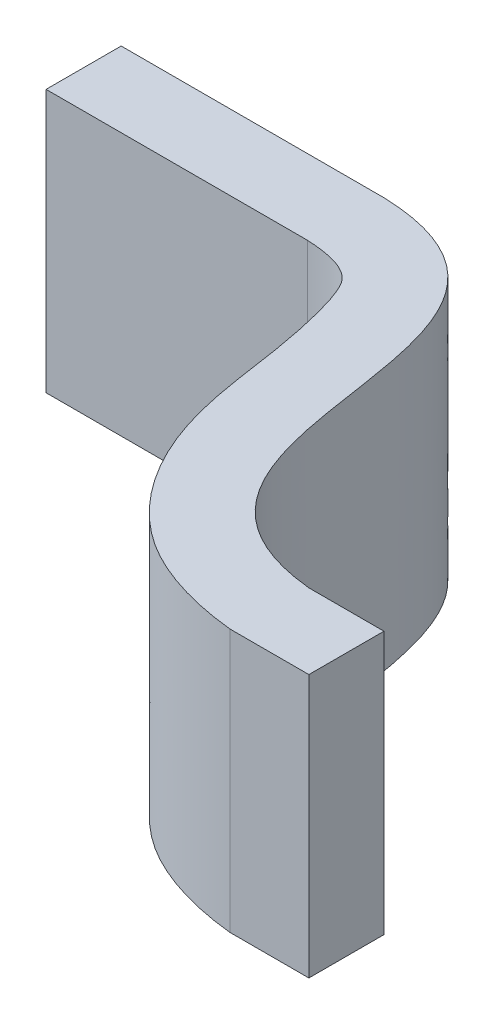
ISO-10303-21;
HEADER;
FILE_DESCRIPTION(('STEP AP214'),'2;1');
FILE_NAME('part.step','',(''),(''),'','','');
FILE_SCHEMA(('AUTOMOTIVE_DESIGN { 1 0 10303 214 1 1 1 1 }'));
ENDSEC;
DATA;
#1=APPLICATION_CONTEXT('core data for automotive mechanical design processes');
#2=APPLICATION_PROTOCOL_DEFINITION('international standard','automotive_design',2000,#1);
#3=PRODUCT_CONTEXT('',#1,'mechanical');
#4=PRODUCT('Part','Part','',(#3));
#5=PRODUCT_RELATED_PRODUCT_CATEGORY('part','',(#4));
#6=PRODUCT_DEFINITION_FORMATION('','',#4);
#7=PRODUCT_DEFINITION_CONTEXT('part definition',#1,'design');
#8=PRODUCT_DEFINITION('design','',#6,#7);
#9=PRODUCT_DEFINITION_SHAPE('','',#8);
#10=(LENGTH_UNIT() NAMED_UNIT(*) SI_UNIT(.MILLI.,.METRE.));
#11=(NAMED_UNIT(*) PLANE_ANGLE_UNIT() SI_UNIT($,.RADIAN.));
#12=(NAMED_UNIT(*) SI_UNIT($,.STERADIAN.) SOLID_ANGLE_UNIT());
#13=UNCERTAINTY_MEASURE_WITH_UNIT(LENGTH_MEASURE(1.E-05),#10,'distance_accuracy_value','');
#14=(GEOMETRIC_REPRESENTATION_CONTEXT(3) GLOBAL_UNCERTAINTY_ASSIGNED_CONTEXT((#13)) GLOBAL_UNIT_ASSIGNED_CONTEXT((#10,
#11,#12)) REPRESENTATION_CONTEXT('',''));
#15=CARTESIAN_POINT('',(0.,0.,0.));
#16=DIRECTION('',(0.,0.,1.));
#17=DIRECTION('',(1.,0.,0.));
#18=AXIS2_PLACEMENT_3D('',#15,#16,#17);
#19=CARTESIAN_POINT('',(0.381062000989914,-1.47687603414217,1.19999994098963));
#20=DIRECTION('',(0.,-1.,-4.37113882867379E-08));
#21=DIRECTION('',(1.,0.,0.));
#22=AXIS2_PLACEMENT_3D('',#19,#20,#21);
#23=PLANE('',#22);
#24=CARTESIAN_POINT('',(-6.65393799901009,-1.47687602539989,0.999999940989626));
#25=CARTESIAN_POINT('',(-6.67603378247592,-1.47687602530467,0.997821450801583));
#26=CARTESIAN_POINT('',(-6.69814608533159,-1.47687602516058,0.994525079742583));
#27=CARTESIAN_POINT('',(-6.74196000230599,-1.47687602474309,0.98497408722883));
#28=CARTESIAN_POINT('',(-6.76365439120462,-1.47687602446828,0.97868722086885));
#29=CARTESIAN_POINT('',(-6.80109928914061,-1.47687602383577,0.964217149326462));
#30=CARTESIAN_POINT('',(-6.81711598043367,-1.47687602350913,0.956744245104065));
#31=CARTESIAN_POINT('',(-6.84771104371223,-1.47687602275081,0.939395998406596));
#32=CARTESIAN_POINT('',(-6.86229582381613,-1.47687602231964,0.929532115974731));
#33=CARTESIAN_POINT('',(-6.88913715455262,-1.47687602137223,0.907857908125021));
#34=CARTESIAN_POINT('',(-6.90145549336788,-1.47687602085934,0.896124168112713));
#35=CARTESIAN_POINT('',(-6.92410333203055,-1.47687601975463,0.870851289617725));
#36=CARTESIAN_POINT('',(-6.93442941955475,-1.47687601916268,0.857309119609302));
#37=CARTESIAN_POINT('',(-6.96672356560466,-1.47687601701589,0.808196481414667));
#38=CARTESIAN_POINT('',(-6.98364579428104,-1.47687601531836,0.769361496281231));
#39=CARTESIAN_POINT('',(-7.00637915120374,-1.47687601228944,0.700067708109999));
#40=CARTESIAN_POINT('',(-7.01393277364121,-1.47687601097706,0.67004395919194));
#41=CARTESIAN_POINT('',(-7.02681062279047,-1.47687600832878,0.609458378700427));
#42=CARTESIAN_POINT('',(-7.03213106678493,-1.47687600699284,0.578895724783763));
#43=CARTESIAN_POINT('',(-7.04523612787774,-1.476876003414,0.497021439048199));
#44=CARTESIAN_POINT('',(-7.0522656284455,-1.4768760011665,0.445604616201525));
#45=CARTESIAN_POINT('',(-7.06583829430569,-1.47687599781692,0.368975133259858));
#46=CARTESIAN_POINT('',(-7.0708647695897,-1.47687599670442,0.343524166788316));
#47=CARTESIAN_POINT('',(-7.08290131021325,-1.4768759945012,0.29312028903324));
#48=CARTESIAN_POINT('',(-7.08990811721131,-1.47687599341044,0.268166631105824));
#49=CARTESIAN_POINT('',(-7.10754242158977,-1.47687599122937,0.21826958117502));
#50=CARTESIAN_POINT('',(-7.11830963205074,-1.47687599014101,0.193370641435788));
#51=CARTESIAN_POINT('',(-7.13814509854049,-1.47687598860283,0.158181201453993));
#52=CARTESIAN_POINT('',(-7.14534233177561,-1.47687598810726,0.146843907751027));
#53=CARTESIAN_POINT('',(-7.16105988122924,-1.47687598715831,0.125134493644536));
#54=CARTESIAN_POINT('',(-7.16957893209141,-1.47687598670489,0.114761465194491));
#55=CARTESIAN_POINT('',(-7.19091439754605,-1.47687598571422,0.0920975480052601));
#56=CARTESIAN_POINT('',(-7.20423043199209,-1.47687598519713,0.0802679863135992));
#57=CARTESIAN_POINT('',(-7.23280529274656,-1.47687598427693,0.0592161697720485));
#58=CARTESIAN_POINT('',(-7.24806736713441,-1.476875983874,0.0499983589534038));
#59=CARTESIAN_POINT('',(-7.28055680499388,-1.47687598316908,0.0338717762435262));
#60=CARTESIAN_POINT('',(-7.29784019259106,-1.47687598287213,0.0270780966533548));
#61=CARTESIAN_POINT('',(-7.33320890349723,-1.47687598238776,0.0159970143758756));
#62=CARTESIAN_POINT('',(-7.35129600434054,-1.47687598220061,0.0117154982372897));
#63=CARTESIAN_POINT('',(-7.383534227059,-1.47687598194948,0.00597045282360196));
#64=CARTESIAN_POINT('',(-7.39761496113673,-1.47687598186693,0.00408176859856541));
#65=CARTESIAN_POINT('',(-7.42577624030721,-1.47687598174668,0.00133077820344091));
#66=CARTESIAN_POINT('',(-7.43985605615936,-1.47687598170866,0.000461176785633499));
#67=CARTESIAN_POINT('',(-7.45393799901012,-1.4768759816885,-5.90103753674717E-08));
#68=B_SPLINE_CURVE_WITH_KNOTS('',3,(#24,#25,#26,#27,#28,#29,#30,#31,#32,#33,#34,#35,#36,#37,#38,
#39,#40,#41,#42,#43,#44,#45,#46,#47,#48,#49,#50,#51,#52,#53,#54,#55,#56,#57,#58,#59,#60,#61,#62,
#63,#64,#65,#66,#67),.UNSPECIFIED.,.F.,.F.,(4,2,2,2,2,2,2,2,2,2,2,2,2,2,2,2,2,2,2,2,2,4),(0.,
0.0667821137090827,0.134301214684022,0.187128508823985,0.239707439757734,0.290518731452926,
0.341416294675052,0.466712259088968,0.559563019654505,0.652570428897917,0.808245450373591,
0.886023921415191,0.963675157190781,1.0445878496654,1.08478909463836,1.12495209032637,
1.17807587168456,1.23128951042009,1.2867700351769,1.34238004906254,1.38496468867344,
1.42724258099922),.UNSPECIFIED.);
#69=CARTESIAN_POINT('',(-6.65393799901009,-1.47687602539989,0.999999940989626));
#70=VERTEX_POINT('',#69);
#71=CARTESIAN_POINT('',(-7.45393799901009,-1.4768759816885,-5.90103741870962E-08));
#72=VERTEX_POINT('',#71);
#73=EDGE_CURVE('E11',#70,#72,#68,.T.);
#74=ORIENTED_EDGE('',*,*,#73,.F.);
#75=DIRECTION('',(-1.,0.,0.));
#76=VECTOR('',#75,1.);
#77=CARTESIAN_POINT('',(-6.45393799901009,-1.47687602539989,0.999999940989626));
#78=LINE('',#77,#76);
#79=CARTESIAN_POINT('',(-6.45393799901009,-1.47687602539989,0.999999940989626));
#80=VERTEX_POINT('',#79);
#81=EDGE_CURVE('E179',#80,#70,#78,.T.);
#82=ORIENTED_EDGE('',*,*,#81,.F.);
#83=DIRECTION('',(0.,4.37113878426487E-08,-0.999999999999999));
#84=VECTOR('',#83,1.);
#85=CARTESIAN_POINT('',(-6.45393799901009,-1.47687603414217,1.19999994098963));
#86=LINE('',#85,#84);
#87=CARTESIAN_POINT('',(-6.45393799901009,-1.47687603414217,1.19999994098963));
#88=VERTEX_POINT('',#87);
#89=EDGE_CURVE('E155',#88,#80,#86,.T.);
#90=ORIENTED_EDGE('',*,*,#89,.F.);
#91=DIRECTION('',(-1.,0.,0.));
#92=VECTOR('',#91,1.);
#93=CARTESIAN_POINT('',(-6.45393799901009,-1.47687603414217,1.19999994098963));
#94=LINE('',#93,#92);
#95=CARTESIAN_POINT('',(-6.66373717585809,-1.47687603414217,1.19999994098963));
#96=VERTEX_POINT('',#95);
#97=EDGE_CURVE('E148',#88,#96,#94,.T.);
#98=ORIENTED_EDGE('',*,*,#97,.T.);
#99=CARTESIAN_POINT('',(-6.66373717585809,-1.47687603414217,1.19999994098963));
#100=CARTESIAN_POINT('',(-6.68237056257263,-1.47687603406166,1.19815808766804));
#101=CARTESIAN_POINT('',(-6.70094738722954,-1.47687603395427,1.19570131124008));
#102=CARTESIAN_POINT('',(-6.7379246105478,-1.47687603368307,1.18949691165288));
#103=CARTESIAN_POINT('',(-6.75632454194431,-1.47687603351913,1.18574651415813));
#104=CARTESIAN_POINT('',(-6.7929675339705,-1.47687603313076,1.17686153782507));
#105=CARTESIAN_POINT('',(-6.81120769181061,-1.47687603290579,1.17171480363105));
#106=CARTESIAN_POINT('',(-6.84718412122,-1.47687603239066,1.15993001092061));
#107=CARTESIAN_POINT('',(-6.86492077676558,-1.47687603210055,1.15329312521039));
#108=CARTESIAN_POINT('',(-6.90550702441668,-1.47687603133701,1.1358254120325));
#109=CARTESIAN_POINT('',(-6.92808530032362,-1.47687603083472,1.12433420692271));
#110=CARTESIAN_POINT('',(-6.97098069443299,-1.47687602967858,1.09788498679643));
#111=CARTESIAN_POINT('',(-6.99130790145501,-1.47687602902546,1.08294345008822));
#112=CARTESIAN_POINT('',(-7.0279727762332,-1.47687602765227,1.05152845303654));
#113=CARTESIAN_POINT('',(-7.04449924398274,-1.47687602694167,1.03527175701928));
#114=CARTESIAN_POINT('',(-7.07543365798622,-1.47687602543449,1.00079143835059));
#115=CARTESIAN_POINT('',(-7.08983601944683,-1.47687602463769,0.982562841549026));
#116=CARTESIAN_POINT('',(-7.11809776879426,-1.47687602287818,0.942310060026029));
#117=CARTESIAN_POINT('',(-7.13168204827002,-1.47687602190706,0.920093273546856));
#118=CARTESIAN_POINT('',(-7.15606790009834,-1.47687601990227,0.874229058403105));
#119=CARTESIAN_POINT('',(-7.16687319447414,-1.47687601886869,0.850583596236032));
#120=CARTESIAN_POINT('',(-7.18657911699553,-1.4768760166685,0.800249067769625));
#121=CARTESIAN_POINT('',(-7.19524763842127,-1.47687601549796,0.773470176491148));
#122=CARTESIAN_POINT('',(-7.20996785968964,-1.4768760131256,0.719196920615698));
#123=CARTESIAN_POINT('',(-7.21601637646933,-1.47687601192374,0.691701728512114));
#124=CARTESIAN_POINT('',(-7.22445706680594,-1.47687600995746,0.646718523761128));
#125=CARTESIAN_POINT('',(-7.22737168105378,-1.47687600919702,0.629321384546686));
#126=CARTESIAN_POINT('',(-7.23282112861414,-1.4768760076734,0.594464976282695));
#127=CARTESIAN_POINT('',(-7.23535587567411,-1.47687600691023,0.577005694041488));
#128=CARTESIAN_POINT('',(-7.24044379035748,-1.47687600538413,0.54209274684554));
#129=CARTESIAN_POINT('',(-7.24299695433449,-1.47687600462121,0.524639081456819));
#130=CARTESIAN_POINT('',(-7.24854024165721,-1.47687600309859,0.489805535822996));
#131=CARTESIAN_POINT('',(-7.25153024685593,-1.47687600233888,0.472425636930946));
#132=CARTESIAN_POINT('',(-7.25940543221582,-1.47687600048513,0.430016827455336));
#133=CARTESIAN_POINT('',(-7.26454124775706,-1.47687599939302,0.405032099238831));
#134=CARTESIAN_POINT('',(-7.27335782095331,-1.47687599776612,0.36781282240836));
#135=CARTESIAN_POINT('',(-7.27648289514104,-1.47687599722559,0.355446901764329));
#136=CARTESIAN_POINT('',(-7.2832453862984,-1.47687599615077,0.330858010833507));
#137=CARTESIAN_POINT('',(-7.28688251537886,-1.47687599561647,0.318634964373173));
#138=CARTESIAN_POINT('',(-7.29335647517369,-1.47687599477453,0.299373308638716));
#139=CARTESIAN_POINT('',(-7.29591902475202,-1.47687599446291,0.292243894867466));
#140=CARTESIAN_POINT('',(-7.30149713681058,-1.47687599384776,0.278171806776029));
#141=CARTESIAN_POINT('',(-7.30451201316556,-1.47687599354423,0.271228868086333));
#142=CARTESIAN_POINT('',(-7.31077994191444,-1.47687599300979,0.258999855834234));
#143=CARTESIAN_POINT('',(-7.31388605246379,-1.47687599277584,0.253644679150387));
#144=CARTESIAN_POINT('',(-7.32081621454635,-1.47687599236773,0.244315938153898));
#145=CARTESIAN_POINT('',(-7.32451240161513,-1.47687599218977,0.24025391737416));
#146=CARTESIAN_POINT('',(-7.33396137139944,-1.47687599183375,0.232075907205086));
#147=CARTESIAN_POINT('',(-7.33999881820825,-1.47687599167144,0.228303992977281));
#148=CARTESIAN_POINT('',(-7.34921547868647,-1.47687599144167,0.223113032707355));
#149=CARTESIAN_POINT('',(-7.35230200427145,-1.47687599136763,0.221466101314979));
#150=CARTESIAN_POINT('',(-7.35859228869369,-1.4768759912373,0.218417312752192));
#151=CARTESIAN_POINT('',(-7.36179572518167,-1.47687599118096,0.217014835421493));
#152=CARTESIAN_POINT('',(-7.37091592035366,-1.47687599103315,0.213464983405925));
#153=CARTESIAN_POINT('',(-7.37694933123149,-1.47687599094972,0.211621640271059));
#154=CARTESIAN_POINT('',(-7.38671809463102,-1.47687599083436,0.209137148338985));
#155=CARTESIAN_POINT('',(-7.3904112741511,-1.47687599079516,0.208309634068498));
#156=CARTESIAN_POINT('',(-7.39782685498994,-1.47687599072686,0.206799599147105));
#157=CARTESIAN_POINT('',(-7.40154925199958,-1.47687599069776,0.206117057516812));
#158=CARTESIAN_POINT('',(-7.41391207862736,-1.47687599060798,0.204032017216307));
#159=CARTESIAN_POINT('',(-7.42259188256675,-1.47687599055604,0.202861051319937));
#160=CARTESIAN_POINT('',(-7.43564284724014,-1.47687599049523,0.201476536264861));
#161=CARTESIAN_POINT('',(-7.4399954739608,-1.47687599047782,0.201077162443525));
#162=CARTESIAN_POINT('',(-7.44871111958986,-1.47687599044936,0.20042393173629));
#163=CARTESIAN_POINT('',(-7.45307413753338,-1.47687599043831,0.200170061830806));
#164=CARTESIAN_POINT('',(-7.45744178074609,-1.47687599043078,0.199999940989626));
#165=B_SPLINE_CURVE_WITH_KNOTS('',3,(#99,#100,#101,#102,#103,#104,#105,#106,#107,#108,#109,#110,
#111,#112,#113,#114,#115,#116,#117,#118,#119,#120,#121,#122,#123,#124,#125,#126,#127,#128,#129,
#130,#131,#132,#133,#134,#135,#136,#137,#138,#139,#140,#141,#142,#143,#144,#145,#146,#147,#148,
#149,#150,#151,#152,#153,#154,#155,#156,#157,#158,#159,#160,#161,#162,#163,#164),.UNSPECIFIED.,
.F.,.F.,(4,2,2,2,2,2,2,2,2,2,2,2,2,2,2,2,2,2,2,2,2,2,2,2,2,2,2,2,2,2,2,2,4),(0.,
0.0561681589095703,0.112457534383136,0.169253578612365,0.22600507790688,0.301715004036538,
0.377070566345996,0.446424912055149,0.515958475234815,0.593880428548582,0.671697467408242,
0.755964517163007,0.840333658382206,0.893247792631837,0.946173923407369,0.99908984816416,
1.05199148781441,1.12847716172405,1.16673541076623,1.20497223539783,1.22769072756633,
1.25037510056686,1.26886797593494,1.28517999290264,1.30634908955326,1.31685139211729,
1.32732665061524,1.34619861049413,1.3575513722042,1.36890248990408,1.39515927363249,
1.40827024085607,1.42138003473644),.UNSPECIFIED.);
#166=CARTESIAN_POINT('',(-7.45744178074609,-1.47687599043078,0.199999940989626));
#167=VERTEX_POINT('',#166);
#168=EDGE_CURVE('E196',#96,#167,#165,.T.);
#169=ORIENTED_EDGE('',*,*,#168,.T.);
#170=DIRECTION('',(1.,0.,0.));
#171=VECTOR('',#170,1.);
#172=CARTESIAN_POINT('',(-8.15393799901009,-1.47687599043078,0.199999940989624));
#173=LINE('',#172,#171);
#174=CARTESIAN_POINT('',(-8.15393799901009,-1.47687599043078,0.199999940989626));
#175=VERTEX_POINT('',#174);
#176=EDGE_CURVE('E102',#175,#167,#173,.T.);
#177=ORIENTED_EDGE('',*,*,#176,.F.);
#178=DIRECTION('',(0.,4.37113878426487E-08,-0.999999999999999));
#179=VECTOR('',#178,1.);
#180=CARTESIAN_POINT('',(-8.15393799901009,-1.47687599043078,0.199999940989626));
#181=LINE('',#180,#179);
#182=CARTESIAN_POINT('',(-8.15393799901009,-1.4768759816885,-5.90103741870962E-08));
#183=VERTEX_POINT('',#182);
#184=EDGE_CURVE('E90',#175,#183,#181,.T.);
#185=ORIENTED_EDGE('',*,*,#184,.T.);
#186=DIRECTION('',(-1.,0.,0.));
#187=VECTOR('',#186,1.);
#188=CARTESIAN_POINT('',(-7.45393799901009,-1.4768759816885,-5.90103741870963E-08));
#189=LINE('',#188,#187);
#190=EDGE_CURVE('E100',#72,#183,#189,.T.);
#191=ORIENTED_EDGE('',*,*,#190,.F.);
#192=EDGE_LOOP('',(#74,#82,#90,#98,#169,#177,#185,#191));
#193=FACE_BOUND('',#192,.T.);
#194=ADVANCED_FACE('F17',(#193),#23,.T.);
#195=CARTESIAN_POINT('',(0.381062000989914,-0.776876034142165,1.1999999715876));
#196=DIRECTION('',(0.,-1.,-4.37113882867379E-08));
#197=DIRECTION('',(1.,0.,0.));
#198=AXIS2_PLACEMENT_3D('',#195,#196,#197);
#199=PLANE('',#198);
#200=DIRECTION('',(-1.,0.,0.));
#201=VECTOR('',#200,1.);
#202=CARTESIAN_POINT('',(-6.45393799901009,-0.776876025399889,0.999999971587598));
#203=LINE('',#202,#201);
#204=CARTESIAN_POINT('',(-6.45393799901009,-0.776876025399888,0.999999971587598));
#205=VERTEX_POINT('',#204);
#206=CARTESIAN_POINT('',(-6.65393799901009,-0.776876025399888,0.999999971587598));
#207=VERTEX_POINT('',#206);
#208=EDGE_CURVE('E30',#205,#207,#203,.T.);
#209=ORIENTED_EDGE('',*,*,#208,.T.);
#210=CARTESIAN_POINT('',(-6.65393799901009,-0.776876025399888,0.999999971587598));
#211=CARTESIAN_POINT('',(-6.67603378247592,-0.776876025304664,0.997821481399555));
#212=CARTESIAN_POINT('',(-6.69814608533159,-0.776876025160575,0.994525110340555));
#213=CARTESIAN_POINT('',(-6.74196000230599,-0.776876024743088,0.984974117826802));
#214=CARTESIAN_POINT('',(-6.76365439120462,-0.776876024468281,0.978687251466822));
#215=CARTESIAN_POINT('',(-6.80109928914061,-0.776876023835774,0.964217179924434));
#216=CARTESIAN_POINT('',(-6.81711598043367,-0.776876023509123,0.956744275702038));
#217=CARTESIAN_POINT('',(-6.84771104371223,-0.776876022750807,0.939396029004568));
#218=CARTESIAN_POINT('',(-6.86229582381613,-0.776876022319643,0.929532146572703));
#219=CARTESIAN_POINT('',(-6.88913715455262,-0.776876021372233,0.907857938722992));
#220=CARTESIAN_POINT('',(-6.90145549336788,-0.776876020859335,0.896124198710684));
#221=CARTESIAN_POINT('',(-6.92410333203055,-0.776876019754622,0.870851320215695));
#222=CARTESIAN_POINT('',(-6.93442941955475,-0.776876019162675,0.857309150207273));
#223=CARTESIAN_POINT('',(-6.96672356560466,-0.776876017015892,0.808196512012639));
#224=CARTESIAN_POINT('',(-6.98364579428104,-0.776876015318361,0.769361526879202));
#225=CARTESIAN_POINT('',(-7.00637915120374,-0.776876012289434,0.700067738707971));
#226=CARTESIAN_POINT('',(-7.01393277364121,-0.776876010977055,0.670043989789912));
#227=CARTESIAN_POINT('',(-7.02681062279047,-0.776876008328776,0.609458409298399));
#228=CARTESIAN_POINT('',(-7.03213106678493,-0.776876006992839,0.578895755381735));
#229=CARTESIAN_POINT('',(-7.04523612787774,-0.776876003414,0.497021469646171));
#230=CARTESIAN_POINT('',(-7.0522656284455,-0.7768760011665,0.445604646799497));
#231=CARTESIAN_POINT('',(-7.06583829430569,-0.776875997816919,0.368975163857829));
#232=CARTESIAN_POINT('',(-7.0708647695897,-0.776875996704422,0.343524197386287));
#233=CARTESIAN_POINT('',(-7.08290131021325,-0.776875994501198,0.293120319631211));
#234=CARTESIAN_POINT('',(-7.08990811721131,-0.776875993410439,0.268166661703795));
#235=CARTESIAN_POINT('',(-7.10754242158977,-0.77687599122937,0.218269611772992));
#236=CARTESIAN_POINT('',(-7.11830963205074,-0.776875990141003,0.19337067203376));
#237=CARTESIAN_POINT('',(-7.13814509854049,-0.776875988602823,0.158181232051964));
#238=CARTESIAN_POINT('',(-7.14534233177561,-0.776875988107255,0.146843938348998));
#239=CARTESIAN_POINT('',(-7.16105988122924,-0.776875987158306,0.125134524242507));
#240=CARTESIAN_POINT('',(-7.16957893209141,-0.776875986704887,0.114761495792462));
#241=CARTESIAN_POINT('',(-7.19091439754605,-0.776875985714216,0.0920975786032325));
#242=CARTESIAN_POINT('',(-7.20423043199209,-0.776875985197129,0.0802680169115713));
#243=CARTESIAN_POINT('',(-7.23280529274656,-0.776875984276924,0.0592162003700204));
#244=CARTESIAN_POINT('',(-7.24806736713441,-0.776875983874001,0.0499983895513757));
#245=CARTESIAN_POINT('',(-7.28055680499388,-0.776875983169086,0.0338718068414981));
#246=CARTESIAN_POINT('',(-7.29784019259106,-0.776875982872125,0.0270781272513266));
#247=CARTESIAN_POINT('',(-7.33320890349723,-0.776875982387755,0.0159970449738474));
#248=CARTESIAN_POINT('',(-7.35129600434054,-0.776875982200603,0.0117155288352615));
#249=CARTESIAN_POINT('',(-7.383534227059,-0.77687598194948,0.00597048342157383));
#250=CARTESIAN_POINT('',(-7.39761496113673,-0.776875981866923,0.00408179919653724));
#251=CARTESIAN_POINT('',(-7.42577624030721,-0.776875981746674,0.00133080880141268));
#252=CARTESIAN_POINT('',(-7.43985605615936,-0.776875981708663,0.000461207383605241));
#253=CARTESIAN_POINT('',(-7.45393799901012,-0.776875981688501,-2.84124036111641E-08));
#254=B_SPLINE_CURVE_WITH_KNOTS('',3,(#210,#211,#212,#213,#214,#215,#216,#217,#218,#219,#220,
#221,#222,#223,#224,#225,#226,#227,#228,#229,#230,#231,#232,#233,#234,#235,#236,#237,#238,#239,
#240,#241,#242,#243,#244,#245,#246,#247,#248,#249,#250,#251,#252,#253),.UNSPECIFIED.,.F.,.F.,(4,
2,2,2,2,2,2,2,2,2,2,2,2,2,2,2,2,2,2,2,2,4),(0.,0.0667821137090827,0.134301214684022,
0.187128508823984,0.239707439757734,0.290518731452926,0.341416294675053,0.466712259088968,
0.559563019654505,0.652570428897917,0.808245450373591,0.886023921415192,0.963675157190782,
1.0445878496654,1.08478909463836,1.12495209032637,1.17807587168456,1.23128951042009,
1.2867700351769,1.34238004906254,1.38496468867344,1.42724258099922),.UNSPECIFIED.);
#255=CARTESIAN_POINT('',(-7.45393799901009,-0.776875981688499,-2.84124023863797E-08));
#256=VERTEX_POINT('',#255);
#257=EDGE_CURVE('E158',#207,#256,#254,.T.);
#258=ORIENTED_EDGE('',*,*,#257,.T.);
#259=DIRECTION('',(-1.,0.,0.));
#260=VECTOR('',#259,1.);
#261=CARTESIAN_POINT('',(-7.45393799901009,-0.776875981688502,-2.84124023863797E-08));
#262=LINE('',#261,#260);
#263=CARTESIAN_POINT('',(-8.15393799901009,-0.776875981688499,-2.84124023863797E-08));
#264=VERTEX_POINT('',#263);
#265=EDGE_CURVE('E151',#256,#264,#262,.T.);
#266=ORIENTED_EDGE('',*,*,#265,.T.);
#267=DIRECTION('',(0.,4.37113883977602E-08,-0.999999999999999));
#268=VECTOR('',#267,1.);
#269=CARTESIAN_POINT('',(-8.15393799901009,-0.776875990430777,0.199999971587598));
#270=LINE('',#269,#268);
#271=CARTESIAN_POINT('',(-8.15393799901009,-0.776875990430777,0.199999971587598));
#272=VERTEX_POINT('',#271);
#273=EDGE_CURVE('E93',#272,#264,#270,.T.);
#274=ORIENTED_EDGE('',*,*,#273,.F.);
#275=DIRECTION('',(1.,0.,0.));
#276=VECTOR('',#275,1.);
#277=CARTESIAN_POINT('',(-8.15393799901009,-0.776875990430779,0.199999971587596));
#278=LINE('',#277,#276);
#279=CARTESIAN_POINT('',(-7.45744178074609,-0.776875990430777,0.199999971587598));
#280=VERTEX_POINT('',#279);
#281=EDGE_CURVE('E193',#272,#280,#278,.T.);
#282=ORIENTED_EDGE('',*,*,#281,.T.);
#283=CARTESIAN_POINT('',(-6.66373717585809,-0.776876034142167,1.1999999715876));
#284=CARTESIAN_POINT('',(-6.68237056257263,-0.776876034061657,1.19815811826601));
#285=CARTESIAN_POINT('',(-6.70094738722954,-0.776876033954268,1.19570134183805));
#286=CARTESIAN_POINT('',(-6.7379246105478,-0.776876033683065,1.18949694225086));
#287=CARTESIAN_POINT('',(-6.75632454194431,-0.77687603351913,1.1857465447561));
#288=CARTESIAN_POINT('',(-6.7929675339705,-0.776876033130755,1.17686156842305));
#289=CARTESIAN_POINT('',(-6.81120769181061,-0.776876032905785,1.17171483422902));
#290=CARTESIAN_POINT('',(-6.84718412122,-0.776876032390654,1.15993004151858));
#291=CARTESIAN_POINT('',(-6.86492077676558,-0.776876032100546,1.15329315580837));
#292=CARTESIAN_POINT('',(-6.90550702441668,-0.776876031337007,1.13582544263048));
#293=CARTESIAN_POINT('',(-6.92808530032362,-0.776876030834712,1.12433423752068));
#294=CARTESIAN_POINT('',(-6.97098069443299,-0.776876029678581,1.0978850173944));
#295=CARTESIAN_POINT('',(-6.99130790145501,-0.776876029025465,1.08294348068619));
#296=CARTESIAN_POINT('',(-7.0279727762332,-0.776876027652272,1.05152848363451));
#297=CARTESIAN_POINT('',(-7.04449924398274,-0.776876026941669,1.03527178761725));
#298=CARTESIAN_POINT('',(-7.07543365798622,-0.776876025434486,1.00079146894856));
#299=CARTESIAN_POINT('',(-7.08983601944683,-0.776876024637688,0.982562872146997));
#300=CARTESIAN_POINT('',(-7.11809776879426,-0.776876022878184,0.942310090624002));
#301=CARTESIAN_POINT('',(-7.13168204827002,-0.776876021907058,0.920093304144828));
#302=CARTESIAN_POINT('',(-7.15606790009834,-0.776876019902269,0.874229089001078));
#303=CARTESIAN_POINT('',(-7.16687319447414,-0.776876018868692,0.850583626834004));
#304=CARTESIAN_POINT('',(-7.18657911699553,-0.776876016668499,0.800249098367596));
#305=CARTESIAN_POINT('',(-7.19524763842127,-0.776876015497958,0.77347020708912));
#306=CARTESIAN_POINT('',(-7.20996785968964,-0.7768760131256,0.71919695121367));
#307=CARTESIAN_POINT('',(-7.21601637646933,-0.776876011923746,0.691701759110086));
#308=CARTESIAN_POINT('',(-7.22445706680594,-0.776876009957468,0.646718554359099));
#309=CARTESIAN_POINT('',(-7.22737168105378,-0.776876009197015,0.629321415144658));
#310=CARTESIAN_POINT('',(-7.23282112861414,-0.776876007673393,0.594465006880667));
#311=CARTESIAN_POINT('',(-7.23535587567411,-0.776876006910224,0.577005724639459));
#312=CARTESIAN_POINT('',(-7.24044379035748,-0.77687600538413,0.542092777443511));
#313=CARTESIAN_POINT('',(-7.24299695433449,-0.776876004621206,0.52463911205479));
#314=CARTESIAN_POINT('',(-7.24854024165721,-0.776876003098584,0.489805566420967));
#315=CARTESIAN_POINT('',(-7.25153024685593,-0.776876002338885,0.472425667528917));
#316=CARTESIAN_POINT('',(-7.25940543221582,-0.776876000485136,0.430016858053307));
#317=CARTESIAN_POINT('',(-7.26454124775707,-0.776875999393016,0.405032129836803));
#318=CARTESIAN_POINT('',(-7.27335782095331,-0.776875997766114,0.367812853006331));
#319=CARTESIAN_POINT('',(-7.27648289514104,-0.776875997225586,0.3554469323623));
#320=CARTESIAN_POINT('',(-7.2832453862984,-0.776875996150762,0.330858041431478));
#321=CARTESIAN_POINT('',(-7.28688251537886,-0.776875995616463,0.318634994971145));
#322=CARTESIAN_POINT('',(-7.29335647517369,-0.776875994774535,0.299373339236688));
#323=CARTESIAN_POINT('',(-7.29591902475202,-0.776875994462918,0.292243925465438));
#324=CARTESIAN_POINT('',(-7.30149713681058,-0.776875993847751,0.278171837374001));
#325=CARTESIAN_POINT('',(-7.30451201316556,-0.77687599354419,0.271228898684305));
#326=CARTESIAN_POINT('',(-7.31077994191444,-0.776875993009832,0.258999886432206));
#327=CARTESIAN_POINT('',(-7.31388605246379,-0.776875992775954,0.253644709748359));
#328=CARTESIAN_POINT('',(-7.32081621454635,-0.776875992367646,0.24431596875187));
#329=CARTESIAN_POINT('',(-7.32451240161513,-0.776875992189457,0.240253947972132));
#330=CARTESIAN_POINT('',(-7.33396137139944,-0.776875991834241,0.232075937803058));
#331=CARTESIAN_POINT('',(-7.33999881820825,-0.776875991673358,0.228304023575253));
#332=CARTESIAN_POINT('',(-7.34921547868647,-0.776875991441997,0.223113063305326));
#333=CARTESIAN_POINT('',(-7.35230200427145,-0.776875991366814,0.22146613191295));
#334=CARTESIAN_POINT('',(-7.35859228869369,-0.776875991238102,0.218417343350162));
#335=CARTESIAN_POINT('',(-7.36179572518167,-0.776875991184519,0.217014866019464));
#336=CARTESIAN_POINT('',(-7.37091592035366,-0.776875991040797,0.213465014003898));
#337=CARTESIAN_POINT('',(-7.37694933123149,-0.776875990955785,0.211621670869031));
#338=CARTESIAN_POINT('',(-7.38671809463102,-0.776875990836678,0.209137178936957));
#339=CARTESIAN_POINT('',(-7.3904112741511,-0.776875990795792,0.20830966466647));
#340=CARTESIAN_POINT('',(-7.39782685498994,-0.776875990726216,0.206799629745077));
#341=CARTESIAN_POINT('',(-7.40154925199958,-0.776875990697524,0.206117088114784));
#342=CARTESIAN_POINT('',(-7.41391207862736,-0.776875990608513,0.204032047814279));
#343=CARTESIAN_POINT('',(-7.42259188256675,-0.776875990556139,0.202861081917908));
#344=CARTESIAN_POINT('',(-7.43564284724014,-0.776875990495174,0.201476566862833));
#345=CARTESIAN_POINT('',(-7.4399954739608,-0.776875990477791,0.201077193041497));
#346=CARTESIAN_POINT('',(-7.44871111958986,-0.776875990449386,0.200423962334262));
#347=CARTESIAN_POINT('',(-7.45307413753338,-0.776875990438363,0.200170092428778));
#348=CARTESIAN_POINT('',(-7.45744178074609,-0.776875990430779,0.199999971587598));
#349=B_SPLINE_CURVE_WITH_KNOTS('',3,(#283,#284,#285,#286,#287,#288,#289,#290,#291,#292,#293,
#294,#295,#296,#297,#298,#299,#300,#301,#302,#303,#304,#305,#306,#307,#308,#309,#310,#311,#312,
#313,#314,#315,#316,#317,#318,#319,#320,#321,#322,#323,#324,#325,#326,#327,#328,#329,#330,#331,
#332,#333,#334,#335,#336,#337,#338,#339,#340,#341,#342,#343,#344,#345,#346,#347,#348),
.UNSPECIFIED.,.F.,.F.,(4,2,2,2,2,2,2,2,2,2,2,2,2,2,2,2,2,2,2,2,2,2,2,2,2,2,2,2,2,2,2,2,4),(0.,
0.0561681589095701,0.112457534383137,0.169253578612363,0.226005077906876,0.301715004036537,
0.377070566345997,0.44642491205515,0.515958475234815,0.593880428548582,0.671697467408242,
0.755964517163007,0.840333658382207,0.893247792631837,0.94617392340737,0.999089848164161,
1.05199148781442,1.12847716172405,1.16673541076623,1.20497223539783,1.22769072756633,
1.25037510056686,1.26886797593494,1.28517999290264,1.30634908955326,1.31685139211729,
1.32732665061524,1.34619861049413,1.3575513722042,1.36890248990408,1.39515927363249,
1.40827024085607,1.42138003473644),.UNSPECIFIED.);
#350=CARTESIAN_POINT('',(-6.66373717585809,-0.776876034142165,1.1999999715876));
#351=VERTEX_POINT('',#350);
#352=EDGE_CURVE('E98',#351,#280,#349,.T.);
#353=ORIENTED_EDGE('',*,*,#352,.F.);
#354=DIRECTION('',(-1.,0.,0.));
#355=VECTOR('',#354,1.);
#356=CARTESIAN_POINT('',(-6.45393799901009,-0.776876034142167,1.1999999715876));
#357=LINE('',#356,#355);
#358=CARTESIAN_POINT('',(-6.45393799901009,-0.776876034142165,1.1999999715876));
#359=VERTEX_POINT('',#358);
#360=EDGE_CURVE('E164',#359,#351,#357,.T.);
#361=ORIENTED_EDGE('',*,*,#360,.F.);
#362=DIRECTION('',(0.,4.37113883977602E-08,-0.999999999999999));
#363=VECTOR('',#362,1.);
#364=CARTESIAN_POINT('',(-6.45393799901009,-0.776876034142165,1.1999999715876));
#365=LINE('',#364,#363);
#366=EDGE_CURVE('E197',#359,#205,#365,.T.);
#367=ORIENTED_EDGE('',*,*,#366,.T.);
#368=EDGE_LOOP('',(#209,#258,#266,#274,#282,#353,#361,#367));
#369=FACE_BOUND('',#368,.T.);
#370=ADVANCED_FACE('F121',(#369),#199,.F.);
#371=CARTESIAN_POINT('',(0.381062000989914,-0.126876034142165,1.2));
#372=DIRECTION('',(0.,-4.37113882867379E-08,1.));
#373=DIRECTION('',(0.,-1.,-4.37113882867379E-08));
#374=AXIS2_PLACEMENT_3D('',#371,#372,#373);
#375=PLANE('',#374);
#376=ORIENTED_EDGE('',*,*,#360,.T.);
#377=DIRECTION('',(0.,-0.999999999999999,-4.37113881598553E-08));
#378=VECTOR('',#377,1.);
#379=CARTESIAN_POINT('',(-6.66373717585809,-0.776876034142165,1.1999999715876));
#380=LINE('',#379,#378);
#381=EDGE_CURVE('E153',#351,#96,#380,.T.);
#382=ORIENTED_EDGE('',*,*,#381,.T.);
#383=ORIENTED_EDGE('',*,*,#97,.F.);
#384=DIRECTION('',(0.,0.999999999999999,4.37113881598553E-08));
#385=VECTOR('',#384,1.);
#386=CARTESIAN_POINT('',(-6.45393799901009,-1.47687603414217,1.19999994098963));
#387=LINE('',#386,#385);
#388=EDGE_CURVE('E191',#88,#359,#387,.T.);
#389=ORIENTED_EDGE('',*,*,#388,.T.);
#390=EDGE_LOOP('',(#376,#382,#383,#389));
#391=FACE_BOUND('',#390,.T.);
#392=ADVANCED_FACE('F172',(#391),#375,.T.);
#393=CARTESIAN_POINT('',(-6.45393799901009,-0.126876034142165,1.2));
#394=DIRECTION('',(-1.,0.,0.));
#395=DIRECTION('',(0.,-1.,-4.37113882867379E-08));
#396=AXIS2_PLACEMENT_3D('',#393,#394,#395);
#397=PLANE('',#396);
#398=ORIENTED_EDGE('',*,*,#89,.T.);
#399=DIRECTION('',(0.,-0.999999999999999,-4.37113881598551E-08));
#400=VECTOR('',#399,1.);
#401=CARTESIAN_POINT('',(-6.45393799901009,-0.776876025399886,0.999999971587598));
#402=LINE('',#401,#400);
#403=EDGE_CURVE('E140',#205,#80,#402,.T.);
#404=ORIENTED_EDGE('',*,*,#403,.F.);
#405=ORIENTED_EDGE('',*,*,#366,.F.);
#406=ORIENTED_EDGE('',*,*,#388,.F.);
#407=EDGE_LOOP('',(#398,#404,#405,#406));
#408=FACE_BOUND('',#407,.T.);
#409=ADVANCED_FACE('F209',(#408),#397,.F.);
#410=CARTESIAN_POINT('',(-8.15393799901009,-0.126876034142165,1.2));
#411=DIRECTION('',(-1.,0.,0.));
#412=DIRECTION('',(0.,-1.,-4.37113882867379E-08));
#413=AXIS2_PLACEMENT_3D('',#410,#411,#412);
#414=PLANE('',#413);
#415=DIRECTION('',(0.,-0.999999999999999,-4.37113883184584E-08));
#416=VECTOR('',#415,1.);
#417=CARTESIAN_POINT('',(-8.15393799901008,-0.776875990430776,0.199999971587598));
#418=LINE('',#417,#416);
#419=EDGE_CURVE('E146',#272,#175,#418,.T.);
#420=ORIENTED_EDGE('',*,*,#419,.F.);
#421=ORIENTED_EDGE('',*,*,#273,.T.);
#422=DIRECTION('',(0.,0.999999999999999,4.37113882867379E-08));
#423=VECTOR('',#422,1.);
#424=CARTESIAN_POINT('',(-8.15393799901008,-1.4768759816885,-5.90103741870962E-08));
#425=LINE('',#424,#423);
#426=EDGE_CURVE('E87',#183,#264,#425,.T.);
#427=ORIENTED_EDGE('',*,*,#426,.F.);
#428=ORIENTED_EDGE('',*,*,#184,.F.);
#429=EDGE_LOOP('',(#420,#421,#427,#428));
#430=FACE_BOUND('',#429,.T.);
#431=ADVANCED_FACE('F89',(#430),#414,.T.);
#432=CARTESIAN_POINT('',(0.381062000989914,-0.126875981688499,0.));
#433=DIRECTION('',(0.,-4.37113882867379E-08,1.));
#434=DIRECTION('',(0.,-1.,-4.37113882867379E-08));
#435=AXIS2_PLACEMENT_3D('',#432,#433,#434);
#436=PLANE('',#435);
#437=ORIENTED_EDGE('',*,*,#265,.F.);
#438=DIRECTION('',(0.,-0.999999999999999,-4.37113882867379E-08));
#439=VECTOR('',#438,1.);
#440=CARTESIAN_POINT('',(-7.45393799901009,-0.776875981688499,-2.84124023863797E-08));
#441=LINE('',#440,#439);
#442=EDGE_CURVE('E97',#256,#72,#441,.T.);
#443=ORIENTED_EDGE('',*,*,#442,.T.);
#444=ORIENTED_EDGE('',*,*,#190,.T.);
#445=ORIENTED_EDGE('',*,*,#426,.T.);
#446=EDGE_LOOP('',(#437,#443,#444,#445));
#447=FACE_BOUND('',#446,.T.);
#448=ADVANCED_FACE('F105',(#447),#436,.F.);
#449=CARTESIAN_POINT('',(0.381062000989914,5.01775443609411,1.00000022487894));
#450=DIRECTION('',(0.,-4.37113882867379E-08,1.));
#451=DIRECTION('',(0.,-1.,-4.37113882867379E-08));
#452=AXIS2_PLACEMENT_3D('',#449,#450,#451);
#453=PLANE('',#452);
#454=ORIENTED_EDGE('',*,*,#81,.T.);
#455=DIRECTION('',(0.,-0.999999999999999,-4.37113881598551E-08));
#456=VECTOR('',#455,1.);
#457=CARTESIAN_POINT('',(-6.65393799901008,-0.776876025399886,0.999999971587598));
#458=LINE('',#457,#456);
#459=EDGE_CURVE('E103',#207,#70,#458,.T.);
#460=ORIENTED_EDGE('',*,*,#459,.F.);
#461=ORIENTED_EDGE('',*,*,#208,.F.);
#462=ORIENTED_EDGE('',*,*,#403,.T.);
#463=EDGE_LOOP('',(#454,#460,#461,#462));
#464=FACE_BOUND('',#463,.T.);
#465=ADVANCED_FACE('F170',(#464),#453,.F.);
#466=CARTESIAN_POINT('',(-6.65393799901009,5.01775443609411,1.00000022487894));
#467=CARTESIAN_POINT('',(-7.29925539715409,5.01775443886489,0.93661226287194));
#468=CARTESIAN_POINT('',(-6.78984128963709,5.01775447886606,0.0214920441178097));
#469=CARTESIAN_POINT('',(-7.45393799901009,5.0177544798055,2.24878939694144E-07));
#470=B_SPLINE_CURVE_WITH_KNOTS('',3,(#466,#467,#468,#469),.UNSPECIFIED.,.F.,.F.,(4,4),(0.,1.),.UNSPECIFIED.);
#471=DIRECTION('',(0.,-0.999999999999999,-4.37113882867379E-08));
#472=VECTOR('',#471,1.);
#473=SURFACE_OF_LINEAR_EXTRUSION('',#470,#472);
#474=ORIENTED_EDGE('',*,*,#73,.T.);
#475=ORIENTED_EDGE('',*,*,#442,.F.);
#476=ORIENTED_EDGE('',*,*,#257,.F.);
#477=ORIENTED_EDGE('',*,*,#459,.T.);
#478=EDGE_LOOP('',(#474,#475,#476,#477));
#479=FACE_BOUND('',#478,.T.);
#480=ADVANCED_FACE('F166',(#479),#473,.F.);
#481=CARTESIAN_POINT('',(0.381062000989914,5.01775447106322,0.20000022487894));
#482=DIRECTION('',(0.,4.37113882867379E-08,-1.));
#483=DIRECTION('',(1.,0.,0.));
#484=AXIS2_PLACEMENT_3D('',#481,#482,#483);
#485=PLANE('',#484);
#486=ORIENTED_EDGE('',*,*,#176,.T.);
#487=DIRECTION('',(0.,-0.999999999999999,-4.37113883184584E-08));
#488=VECTOR('',#487,1.);
#489=CARTESIAN_POINT('',(-7.45744178074608,-0.776875990430776,0.199999971587598));
#490=LINE('',#489,#488);
#491=EDGE_CURVE('E107',#280,#167,#490,.T.);
#492=ORIENTED_EDGE('',*,*,#491,.F.);
#493=ORIENTED_EDGE('',*,*,#281,.F.);
#494=ORIENTED_EDGE('',*,*,#419,.T.);
#495=EDGE_LOOP('',(#486,#492,#493,#494));
#496=FACE_BOUND('',#495,.T.);
#497=ADVANCED_FACE('F129',(#496),#485,.F.);
#498=CARTESIAN_POINT('',(-6.66373717585809,5.01775442735183,1.20000022487894));
#499=CARTESIAN_POINT('',(-6.76111157736509,5.01775442776993,1.19043537372094));
#500=CARTESIAN_POINT('',(-6.96545999269509,5.01775443018266,1.13523848292794));
#501=CARTESIAN_POINT('',(-7.20605275525609,5.01775444236442,0.85655227210794));
#502=CARTESIAN_POINT('',(-7.23834982502609,5.01775445822105,0.49379478761794));
#503=CARTESIAN_POINT('',(-7.29819788966409,5.01775446848464,0.25899132482694));
#504=CARTESIAN_POINT('',(-7.33605449676609,5.0177544697967,0.22897490490494));
#505=CARTESIAN_POINT('',(-7.37899552435409,5.01775447070118,0.20828275194794));
#506=CARTESIAN_POINT('',(-7.43390389640609,5.01775447102387,0.20090043049794));
#507=CARTESIAN_POINT('',(-7.45744178074609,5.01775447106322,0.20000022487894));
#508=B_SPLINE_CURVE_WITH_KNOTS('',3,(#498,#499,#500,#501,#502,#503,#504,#505,#506,#507),
.UNSPECIFIED.,.F.,.F.,(4,1,1,1,1,1,1,4),(-0.005037439357121,0.120331553469,0.245700546295,
0.496438531947,0.747176517599,0.872545510425,0.935230006838,0.997914503251),.UNSPECIFIED.);
#509=DIRECTION('',(0.,-0.999999999999999,-4.37113882867379E-08));
#510=VECTOR('',#509,1.);
#511=SURFACE_OF_LINEAR_EXTRUSION('',#508,#510);
#512=ORIENTED_EDGE('',*,*,#381,.F.);
#513=ORIENTED_EDGE('',*,*,#352,.T.);
#514=ORIENTED_EDGE('',*,*,#491,.T.);
#515=ORIENTED_EDGE('',*,*,#168,.F.);
#516=EDGE_LOOP('',(#512,#513,#514,#515));
#517=FACE_BOUND('',#516,.T.);
#518=ADVANCED_FACE('F123',(#517),#511,.T.);
#519=CLOSED_SHELL('',(#194,#370,#392,#409,#431,#448,#465,#480,#497,#518));
#520=MANIFOLD_SOLID_BREP('B1',#519);
#521=ADVANCED_BREP_SHAPE_REPRESENTATION('',(#18,#520),#14);
#522=SHAPE_DEFINITION_REPRESENTATION(#9,#521);
ENDSEC;
END-ISO-10303-21;
